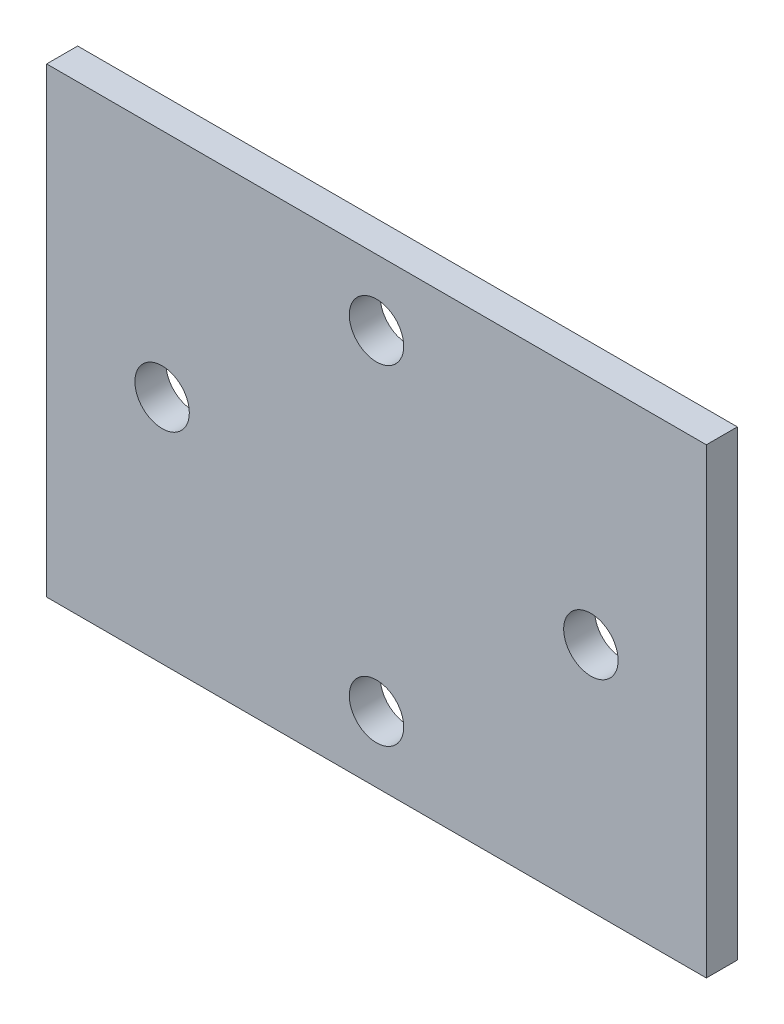
ISO-10303-21;
HEADER;
FILE_DESCRIPTION(('STEP AP214'),'2;1');
FILE_NAME('part.step','',(''),(''),'','','');
FILE_SCHEMA(('AUTOMOTIVE_DESIGN { 1 0 10303 214 1 1 1 1 }'));
ENDSEC;
DATA;
#1=APPLICATION_CONTEXT('core data for automotive mechanical design processes');
#2=APPLICATION_PROTOCOL_DEFINITION('international standard','automotive_design',2000,#1);
#3=PRODUCT_CONTEXT('',#1,'mechanical');
#4=PRODUCT('Part','Part','',(#3));
#5=PRODUCT_RELATED_PRODUCT_CATEGORY('part','',(#4));
#6=PRODUCT_DEFINITION_FORMATION('','',#4);
#7=PRODUCT_DEFINITION_CONTEXT('part definition',#1,'design');
#8=PRODUCT_DEFINITION('design','',#6,#7);
#9=PRODUCT_DEFINITION_SHAPE('','',#8);
#10=(LENGTH_UNIT() NAMED_UNIT(*) SI_UNIT(.MILLI.,.METRE.));
#11=(NAMED_UNIT(*) PLANE_ANGLE_UNIT() SI_UNIT($,.RADIAN.));
#12=(NAMED_UNIT(*) SI_UNIT($,.STERADIAN.) SOLID_ANGLE_UNIT());
#13=UNCERTAINTY_MEASURE_WITH_UNIT(LENGTH_MEASURE(1.E-05),#10,'distance_accuracy_value','');
#14=(GEOMETRIC_REPRESENTATION_CONTEXT(3) GLOBAL_UNCERTAINTY_ASSIGNED_CONTEXT((#13)) GLOBAL_UNIT_ASSIGNED_CONTEXT((#10,
#11,#12)) REPRESENTATION_CONTEXT('',''));
#15=CARTESIAN_POINT('',(0.,0.,0.));
#16=DIRECTION('',(0.,0.,1.));
#17=DIRECTION('',(1.,0.,0.));
#18=AXIS2_PLACEMENT_3D('',#15,#16,#17);
#19=CARTESIAN_POINT('',(-50.8,35.56,-2.3886));
#20=DIRECTION('',(0.,1.,0.));
#21=DIRECTION('',(0.,0.,1.));
#22=AXIS2_PLACEMENT_3D('',#19,#20,#21);
#23=PLANE('',#22);
#24=DIRECTION('',(0.,0.,1.));
#25=VECTOR('',#24,1.);
#26=CARTESIAN_POINT('',(50.8,35.56,-2.3886));
#27=LINE('',#26,#25);
#28=CARTESIAN_POINT('',(50.8,35.56,-2.3876));
#29=VERTEX_POINT('',#28);
#30=CARTESIAN_POINT('',(50.8,35.56,2.3876));
#31=VERTEX_POINT('',#30);
#32=EDGE_CURVE('E92',#29,#31,#27,.T.);
#33=ORIENTED_EDGE('',*,*,#32,.F.);
#34=DIRECTION('',(-1.,0.,0.));
#35=VECTOR('',#34,1.);
#36=CARTESIAN_POINT('',(-50.8,35.56,-2.3876));
#37=LINE('',#36,#35);
#38=CARTESIAN_POINT('',(-50.8,35.56,-2.3876));
#39=VERTEX_POINT('',#38);
#40=EDGE_CURVE('E103',#29,#39,#37,.T.);
#41=ORIENTED_EDGE('',*,*,#40,.T.);
#42=DIRECTION('',(0.,0.,1.));
#43=VECTOR('',#42,1.);
#44=CARTESIAN_POINT('',(-50.8,35.56,-2.3886));
#45=LINE('',#44,#43);
#46=CARTESIAN_POINT('',(-50.8,35.56,2.3876));
#47=VERTEX_POINT('',#46);
#48=EDGE_CURVE('E59',#39,#47,#45,.T.);
#49=ORIENTED_EDGE('',*,*,#48,.T.);
#50=DIRECTION('',(-1.,0.,0.));
#51=VECTOR('',#50,1.);
#52=CARTESIAN_POINT('',(-50.8,35.56,2.3876));
#53=LINE('',#52,#51);
#54=EDGE_CURVE('E84',#31,#47,#53,.T.);
#55=ORIENTED_EDGE('',*,*,#54,.F.);
#56=EDGE_LOOP('',(#33,#41,#49,#55));
#57=FACE_BOUND('',#56,.T.);
#58=ADVANCED_FACE('F37',(#57),#23,.T.);
#59=CARTESIAN_POINT('',(50.8,-25.4,-2.3876));
#60=DIRECTION('',(1.,0.,0.));
#61=DIRECTION('',(0.,1.,0.));
#62=AXIS2_PLACEMENT_3D('',#59,#60,#61);
#63=PLANE('',#62);
#64=DIRECTION('',(0.,1.,0.));
#65=VECTOR('',#64,1.);
#66=CARTESIAN_POINT('',(50.8,-25.4,2.3876));
#67=LINE('',#66,#65);
#68=CARTESIAN_POINT('',(50.8,-35.56,2.3876));
#69=VERTEX_POINT('',#68);
#70=EDGE_CURVE('E79',#69,#31,#67,.T.);
#71=ORIENTED_EDGE('',*,*,#70,.F.);
#72=DIRECTION('',(0.,0.,1.));
#73=VECTOR('',#72,1.);
#74=CARTESIAN_POINT('',(50.8,-35.56,-2.3886));
#75=LINE('',#74,#73);
#76=CARTESIAN_POINT('',(50.8,-35.56,-2.3876));
#77=VERTEX_POINT('',#76);
#78=EDGE_CURVE('E101',#77,#69,#75,.T.);
#79=ORIENTED_EDGE('',*,*,#78,.F.);
#80=DIRECTION('',(0.,1.,0.));
#81=VECTOR('',#80,1.);
#82=CARTESIAN_POINT('',(50.8,-25.4,-2.3876));
#83=LINE('',#82,#81);
#84=EDGE_CURVE('E11',#77,#29,#83,.T.);
#85=ORIENTED_EDGE('',*,*,#84,.T.);
#86=ORIENTED_EDGE('',*,*,#32,.T.);
#87=EDGE_LOOP('',(#71,#79,#85,#86));
#88=FACE_BOUND('',#87,.T.);
#89=ADVANCED_FACE('F93',(#88),#63,.T.);
#90=CARTESIAN_POINT('',(-50.8,-50.8,-2.3876));
#91=DIRECTION('',(-1.,0.,0.));
#92=DIRECTION('',(0.,-1.,0.));
#93=AXIS2_PLACEMENT_3D('',#90,#91,#92);
#94=PLANE('',#93);
#95=DIRECTION('',(0.,-1.,0.));
#96=VECTOR('',#95,1.);
#97=CARTESIAN_POINT('',(-50.8,-50.8,-2.3876));
#98=LINE('',#97,#96);
#99=CARTESIAN_POINT('',(-50.8,-35.56,-2.3876));
#100=VERTEX_POINT('',#99);
#101=EDGE_CURVE('E45',#39,#100,#98,.T.);
#102=ORIENTED_EDGE('',*,*,#101,.T.);
#103=DIRECTION('',(0.,0.,1.));
#104=VECTOR('',#103,1.);
#105=CARTESIAN_POINT('',(-50.8,-35.56,-2.3886));
#106=LINE('',#105,#104);
#107=CARTESIAN_POINT('',(-50.8,-35.56,2.3876));
#108=VERTEX_POINT('',#107);
#109=EDGE_CURVE('E104',#100,#108,#106,.T.);
#110=ORIENTED_EDGE('',*,*,#109,.T.);
#111=DIRECTION('',(0.,-1.,0.));
#112=VECTOR('',#111,1.);
#113=CARTESIAN_POINT('',(-50.8,-50.8,2.3876));
#114=LINE('',#113,#112);
#115=EDGE_CURVE('E89',#47,#108,#114,.T.);
#116=ORIENTED_EDGE('',*,*,#115,.F.);
#117=ORIENTED_EDGE('',*,*,#48,.F.);
#118=EDGE_LOOP('',(#102,#110,#116,#117));
#119=FACE_BOUND('',#118,.T.);
#120=ADVANCED_FACE('F39',(#119),#94,.T.);
#121=CARTESIAN_POINT('',(0.,0.,-2.3876));
#122=DIRECTION('',(0.,0.,-1.));
#123=DIRECTION('',(-1.,0.,0.));
#124=AXIS2_PLACEMENT_3D('',#121,#122,#123);
#125=PLANE('',#124);
#126=CARTESIAN_POINT('',(-33.02,0.,-2.3876));
#127=DIRECTION('',(0.,0.,1.));
#128=DIRECTION('',(1.,0.,0.));
#129=AXIS2_PLACEMENT_3D('',#126,#127,#128);
#130=CIRCLE('',#129,4.191);
#131=CARTESIAN_POINT('',(-28.829,0.,-2.3876));
#132=VERTEX_POINT('',#131);
#133=EDGE_CURVE('E110',#132,#132,#130,.T.);
#134=ORIENTED_EDGE('',*,*,#133,.T.);
#135=EDGE_LOOP('',(#134));
#136=FACE_BOUND('',#135,.T.);
#137=CARTESIAN_POINT('',(33.02,0.,-2.3876));
#138=DIRECTION('',(0.,0.,1.));
#139=DIRECTION('',(1.,0.,0.));
#140=AXIS2_PLACEMENT_3D('',#137,#138,#139);
#141=CIRCLE('',#140,4.191);
#142=CARTESIAN_POINT('',(37.211,0.,-2.3876));
#143=VERTEX_POINT('',#142);
#144=EDGE_CURVE('E119',#143,#143,#141,.T.);
#145=ORIENTED_EDGE('',*,*,#144,.T.);
#146=EDGE_LOOP('',(#145));
#147=FACE_BOUND('',#146,.T.);
#148=CARTESIAN_POINT('',(0.,25.4,-2.3876));
#149=DIRECTION('',(0.,0.,1.));
#150=DIRECTION('',(1.,0.,0.));
#151=AXIS2_PLACEMENT_3D('',#148,#149,#150);
#152=CIRCLE('',#151,4.191);
#153=CARTESIAN_POINT('',(4.191,25.4,-2.3876));
#154=VERTEX_POINT('',#153);
#155=EDGE_CURVE('E125',#154,#154,#152,.T.);
#156=ORIENTED_EDGE('',*,*,#155,.T.);
#157=EDGE_LOOP('',(#156));
#158=FACE_BOUND('',#157,.T.);
#159=CARTESIAN_POINT('',(0.,-25.4,-2.3876));
#160=DIRECTION('',(0.,0.,1.));
#161=DIRECTION('',(-1.,0.,0.));
#162=AXIS2_PLACEMENT_3D('',#159,#160,#161);
#163=CIRCLE('',#162,4.191);
#164=CARTESIAN_POINT('',(-4.19099999999999,-25.4,-2.3876));
#165=VERTEX_POINT('',#164);
#166=EDGE_CURVE('E109',#165,#165,#163,.T.);
#167=ORIENTED_EDGE('',*,*,#166,.T.);
#168=EDGE_LOOP('',(#167));
#169=FACE_BOUND('',#168,.T.);
#170=ORIENTED_EDGE('',*,*,#84,.F.);
#171=DIRECTION('',(1.,0.,0.));
#172=VECTOR('',#171,1.);
#173=CARTESIAN_POINT('',(-50.8,-35.56,-2.3876));
#174=LINE('',#173,#172);
#175=EDGE_CURVE('E52',#100,#77,#174,.T.);
#176=ORIENTED_EDGE('',*,*,#175,.F.);
#177=ORIENTED_EDGE('',*,*,#101,.F.);
#178=ORIENTED_EDGE('',*,*,#40,.F.);
#179=EDGE_LOOP('',(#170,#176,#177,#178));
#180=FACE_BOUND('',#179,.T.);
#181=ADVANCED_FACE('F136',(#136,#147,#158,#169,#180),#125,.T.);
#182=CARTESIAN_POINT('',(0.,0.,2.3876));
#183=DIRECTION('',(0.,0.,-1.));
#184=DIRECTION('',(-1.,0.,0.));
#185=AXIS2_PLACEMENT_3D('',#182,#183,#184);
#186=PLANE('',#185);
#187=DIRECTION('',(1.,0.,0.));
#188=VECTOR('',#187,1.);
#189=CARTESIAN_POINT('',(-50.8,-35.56,2.3876));
#190=LINE('',#189,#188);
#191=EDGE_CURVE('E86',#108,#69,#190,.T.);
#192=ORIENTED_EDGE('',*,*,#191,.T.);
#193=ORIENTED_EDGE('',*,*,#70,.T.);
#194=ORIENTED_EDGE('',*,*,#54,.T.);
#195=ORIENTED_EDGE('',*,*,#115,.T.);
#196=EDGE_LOOP('',(#192,#193,#194,#195));
#197=FACE_BOUND('',#196,.T.);
#198=CARTESIAN_POINT('',(-33.02,0.,2.3876));
#199=DIRECTION('',(0.,0.,1.));
#200=DIRECTION('',(1.,0.,0.));
#201=AXIS2_PLACEMENT_3D('',#198,#199,#200);
#202=CIRCLE('',#201,4.191);
#203=CARTESIAN_POINT('',(-28.829,0.,2.3876));
#204=VERTEX_POINT('',#203);
#205=EDGE_CURVE('E113',#204,#204,#202,.T.);
#206=ORIENTED_EDGE('',*,*,#205,.F.);
#207=EDGE_LOOP('',(#206));
#208=FACE_BOUND('',#207,.T.);
#209=CARTESIAN_POINT('',(33.02,0.,2.3876));
#210=DIRECTION('',(0.,0.,1.));
#211=DIRECTION('',(1.,0.,0.));
#212=AXIS2_PLACEMENT_3D('',#209,#210,#211);
#213=CIRCLE('',#212,4.191);
#214=CARTESIAN_POINT('',(37.211,0.,2.3876));
#215=VERTEX_POINT('',#214);
#216=EDGE_CURVE('E116',#215,#215,#213,.T.);
#217=ORIENTED_EDGE('',*,*,#216,.F.);
#218=EDGE_LOOP('',(#217));
#219=FACE_BOUND('',#218,.T.);
#220=CARTESIAN_POINT('',(0.,25.4,2.3876));
#221=DIRECTION('',(0.,0.,1.));
#222=DIRECTION('',(1.,0.,0.));
#223=AXIS2_PLACEMENT_3D('',#220,#221,#222);
#224=CIRCLE('',#223,4.191);
#225=CARTESIAN_POINT('',(4.191,25.4,2.3876));
#226=VERTEX_POINT('',#225);
#227=EDGE_CURVE('E122',#226,#226,#224,.T.);
#228=ORIENTED_EDGE('',*,*,#227,.F.);
#229=EDGE_LOOP('',(#228));
#230=FACE_BOUND('',#229,.T.);
#231=CARTESIAN_POINT('',(0.,-25.4,2.3876));
#232=DIRECTION('',(0.,0.,1.));
#233=DIRECTION('',(-1.,0.,0.));
#234=AXIS2_PLACEMENT_3D('',#231,#232,#233);
#235=CIRCLE('',#234,4.191);
#236=CARTESIAN_POINT('',(-4.19099999999999,-25.4,2.3876));
#237=VERTEX_POINT('',#236);
#238=EDGE_CURVE('E128',#237,#237,#235,.T.);
#239=ORIENTED_EDGE('',*,*,#238,.F.);
#240=EDGE_LOOP('',(#239));
#241=FACE_BOUND('',#240,.T.);
#242=ADVANCED_FACE('F81',(#197,#208,#219,#230,#241),#186,.F.);
#243=CARTESIAN_POINT('',(0.,-25.4,-2.3876));
#244=DIRECTION('',(0.,0.,1.));
#245=DIRECTION('',(1.,0.,0.));
#246=AXIS2_PLACEMENT_3D('',#243,#244,#245);
#247=CYLINDRICAL_SURFACE('',#246,4.191);
#248=ORIENTED_EDGE('',*,*,#166,.F.);
#249=EDGE_LOOP('',(#248));
#250=FACE_BOUND('',#249,.T.);
#251=ORIENTED_EDGE('',*,*,#238,.T.);
#252=EDGE_LOOP('',(#251));
#253=FACE_BOUND('',#252,.T.);
#254=ADVANCED_FACE('F144',(#250,#253),#247,.F.);
#255=CARTESIAN_POINT('',(0.,25.4,-2.3876));
#256=DIRECTION('',(0.,0.,1.));
#257=DIRECTION('',(1.,0.,0.));
#258=AXIS2_PLACEMENT_3D('',#255,#256,#257);
#259=CYLINDRICAL_SURFACE('',#258,4.191);
#260=ORIENTED_EDGE('',*,*,#155,.F.);
#261=EDGE_LOOP('',(#260));
#262=FACE_BOUND('',#261,.T.);
#263=ORIENTED_EDGE('',*,*,#227,.T.);
#264=EDGE_LOOP('',(#263));
#265=FACE_BOUND('',#264,.T.);
#266=ADVANCED_FACE('F161',(#262,#265),#259,.F.);
#267=CARTESIAN_POINT('',(33.02,0.,-2.3876));
#268=DIRECTION('',(0.,0.,1.));
#269=DIRECTION('',(1.,0.,0.));
#270=AXIS2_PLACEMENT_3D('',#267,#268,#269);
#271=CYLINDRICAL_SURFACE('',#270,4.191);
#272=ORIENTED_EDGE('',*,*,#144,.F.);
#273=EDGE_LOOP('',(#272));
#274=FACE_BOUND('',#273,.T.);
#275=ORIENTED_EDGE('',*,*,#216,.T.);
#276=EDGE_LOOP('',(#275));
#277=FACE_BOUND('',#276,.T.);
#278=ADVANCED_FACE('F157',(#274,#277),#271,.F.);
#279=CARTESIAN_POINT('',(-33.02,0.,-2.3876));
#280=DIRECTION('',(0.,0.,1.));
#281=DIRECTION('',(1.,0.,0.));
#282=AXIS2_PLACEMENT_3D('',#279,#280,#281);
#283=CYLINDRICAL_SURFACE('',#282,4.191);
#284=ORIENTED_EDGE('',*,*,#133,.F.);
#285=EDGE_LOOP('',(#284));
#286=FACE_BOUND('',#285,.T.);
#287=ORIENTED_EDGE('',*,*,#205,.T.);
#288=EDGE_LOOP('',(#287));
#289=FACE_BOUND('',#288,.T.);
#290=ADVANCED_FACE('F154',(#286,#289),#283,.F.);
#291=CARTESIAN_POINT('',(-50.8,-35.56,-2.3886));
#292=DIRECTION('',(0.,-1.,0.));
#293=DIRECTION('',(0.,0.,-1.));
#294=AXIS2_PLACEMENT_3D('',#291,#292,#293);
#295=PLANE('',#294);
#296=ORIENTED_EDGE('',*,*,#109,.F.);
#297=ORIENTED_EDGE('',*,*,#175,.T.);
#298=ORIENTED_EDGE('',*,*,#78,.T.);
#299=ORIENTED_EDGE('',*,*,#191,.F.);
#300=EDGE_LOOP('',(#296,#297,#298,#299));
#301=FACE_BOUND('',#300,.T.);
#302=ADVANCED_FACE('F135',(#301),#295,.T.);
#303=CLOSED_SHELL('',(#58,#89,#120,#181,#242,#254,#266,#278,#290,#302));
#304=MANIFOLD_SOLID_BREP('B2',#303);
#305=ADVANCED_BREP_SHAPE_REPRESENTATION('',(#18,#304),#14);
#306=SHAPE_DEFINITION_REPRESENTATION(#9,#305);
ENDSEC;
END-ISO-10303-21;
